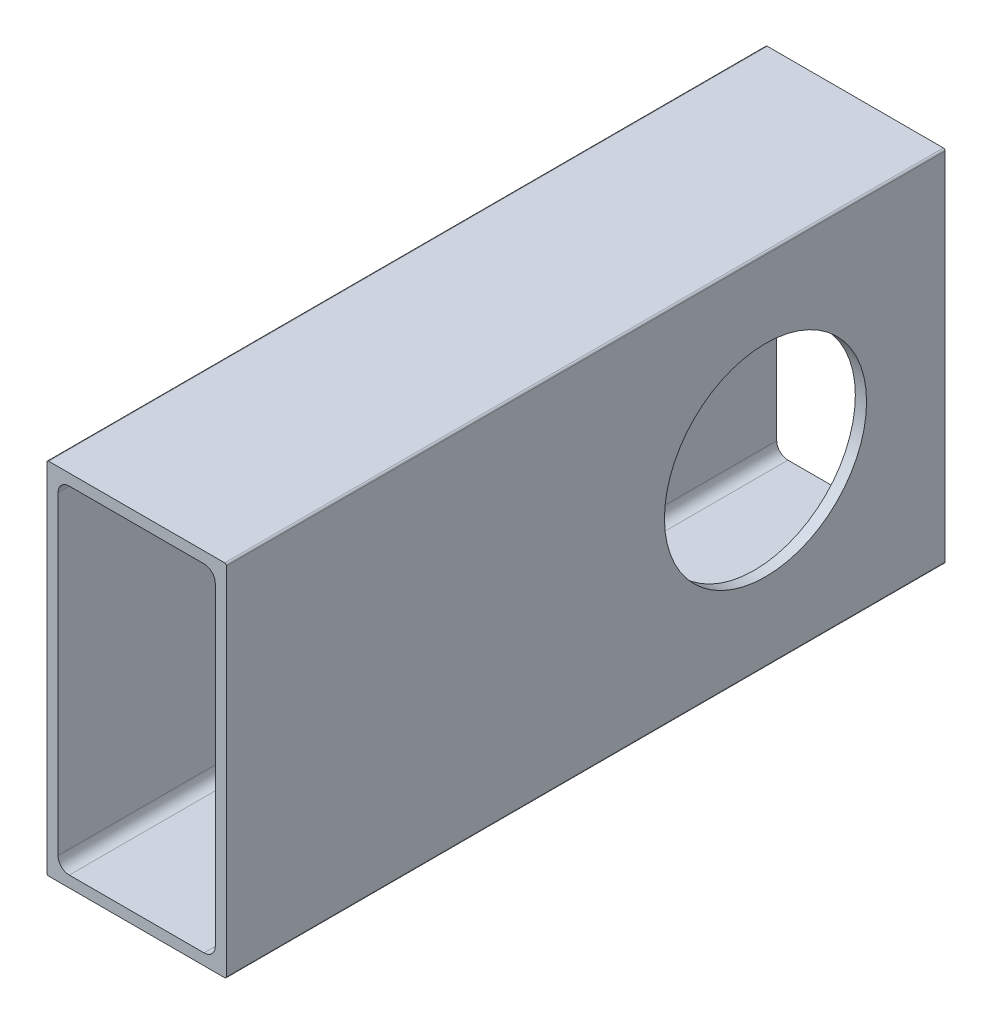
ISO-10303-21;
HEADER;
FILE_DESCRIPTION(('STEP AP214'),'2;1');
FILE_NAME('part.step','',(''),(''),'','','');
FILE_SCHEMA(('AUTOMOTIVE_DESIGN { 1 0 10303 214 1 1 1 1 }'));
ENDSEC;
DATA;
#1=APPLICATION_CONTEXT('core data for automotive mechanical design processes');
#2=APPLICATION_PROTOCOL_DEFINITION('international standard','automotive_design',2000,#1);
#3=PRODUCT_CONTEXT('',#1,'mechanical');
#4=PRODUCT('Part','Part','',(#3));
#5=PRODUCT_RELATED_PRODUCT_CATEGORY('part','',(#4));
#6=PRODUCT_DEFINITION_FORMATION('','',#4);
#7=PRODUCT_DEFINITION_CONTEXT('part definition',#1,'design');
#8=PRODUCT_DEFINITION('design','',#6,#7);
#9=PRODUCT_DEFINITION_SHAPE('','',#8);
#10=(LENGTH_UNIT() NAMED_UNIT(*) SI_UNIT(.MILLI.,.METRE.));
#11=(NAMED_UNIT(*) PLANE_ANGLE_UNIT() SI_UNIT($,.RADIAN.));
#12=(NAMED_UNIT(*) SI_UNIT($,.STERADIAN.) SOLID_ANGLE_UNIT());
#13=UNCERTAINTY_MEASURE_WITH_UNIT(LENGTH_MEASURE(1.E-05),#10,'distance_accuracy_value','');
#14=(GEOMETRIC_REPRESENTATION_CONTEXT(3) GLOBAL_UNCERTAINTY_ASSIGNED_CONTEXT((#13)) GLOBAL_UNIT_ASSIGNED_CONTEXT((#10,
#11,#12)) REPRESENTATION_CONTEXT('',''));
#15=CARTESIAN_POINT('',(0.,0.,0.));
#16=DIRECTION('',(0.,0.,1.));
#17=DIRECTION('',(1.,0.,0.));
#18=AXIS2_PLACEMENT_3D('',#15,#16,#17);
#19=CARTESIAN_POINT('',(12.446,25.146,101.6));
#20=DIRECTION('',(0.,0.,-1.));
#21=DIRECTION('',(-1.,0.,0.));
#22=AXIS2_PLACEMENT_3D('',#19,#20,#21);
#23=CYLINDRICAL_SURFACE('',#22,0.253999999999998);
#24=CARTESIAN_POINT('',(12.446,25.146,0.));
#25=DIRECTION('',(0.,0.,-1.));
#26=DIRECTION('',(-1.,0.,0.));
#27=AXIS2_PLACEMENT_3D('',#24,#25,#26);
#28=CIRCLE('',#27,0.253999999999998);
#29=CARTESIAN_POINT('',(12.446,25.4,0.));
#30=VERTEX_POINT('',#29);
#31=CARTESIAN_POINT('',(12.7,25.146,0.));
#32=VERTEX_POINT('',#31);
#33=EDGE_CURVE('E208',#30,#32,#28,.T.);
#34=ORIENTED_EDGE('',*,*,#33,.F.);
#35=DIRECTION('',(0.,0.,-1.));
#36=VECTOR('',#35,1.);
#37=CARTESIAN_POINT('',(12.446,25.4,101.6));
#38=LINE('',#37,#36);
#39=CARTESIAN_POINT('',(12.446,25.4,101.6));
#40=VERTEX_POINT('',#39);
#41=EDGE_CURVE('E11',#40,#30,#38,.T.);
#42=ORIENTED_EDGE('',*,*,#41,.F.);
#43=CARTESIAN_POINT('',(12.446,25.146,101.6));
#44=DIRECTION('',(0.,0.,-1.));
#45=DIRECTION('',(-1.,0.,0.));
#46=AXIS2_PLACEMENT_3D('',#43,#44,#45);
#47=CIRCLE('',#46,0.253999999999998);
#48=CARTESIAN_POINT('',(12.7,25.146,101.6));
#49=VERTEX_POINT('',#48);
#50=EDGE_CURVE('E220',#40,#49,#47,.T.);
#51=ORIENTED_EDGE('',*,*,#50,.T.);
#52=DIRECTION('',(0.,0.,-1.));
#53=VECTOR('',#52,1.);
#54=CARTESIAN_POINT('',(12.7,25.146,101.6));
#55=LINE('',#54,#53);
#56=EDGE_CURVE('E245',#49,#32,#55,.T.);
#57=ORIENTED_EDGE('',*,*,#56,.T.);
#58=EDGE_LOOP('',(#34,#42,#51,#57));
#59=FACE_BOUND('',#58,.T.);
#60=ADVANCED_FACE('F35',(#59),#23,.T.);
#61=CARTESIAN_POINT('',(-12.446,25.4,101.6));
#62=DIRECTION('',(0.,1.,0.));
#63=DIRECTION('',(0.,0.,1.));
#64=AXIS2_PLACEMENT_3D('',#61,#62,#63);
#65=PLANE('',#64);
#66=DIRECTION('',(1.,0.,0.));
#67=VECTOR('',#66,1.);
#68=CARTESIAN_POINT('',(-12.446,25.4,0.));
#69=LINE('',#68,#67);
#70=CARTESIAN_POINT('',(-12.446,25.4,0.));
#71=VERTEX_POINT('',#70);
#72=EDGE_CURVE('E224',#71,#30,#69,.T.);
#73=ORIENTED_EDGE('',*,*,#72,.F.);
#74=DIRECTION('',(0.,0.,-1.));
#75=VECTOR('',#74,1.);
#76=CARTESIAN_POINT('',(-12.446,25.4,101.6));
#77=LINE('',#76,#75);
#78=CARTESIAN_POINT('',(-12.446,25.4,101.6));
#79=VERTEX_POINT('',#78);
#80=EDGE_CURVE('E43',#79,#71,#77,.T.);
#81=ORIENTED_EDGE('',*,*,#80,.F.);
#82=DIRECTION('',(1.,0.,0.));
#83=VECTOR('',#82,1.);
#84=CARTESIAN_POINT('',(-12.446,25.4,101.6));
#85=LINE('',#84,#83);
#86=EDGE_CURVE('E242',#79,#40,#85,.T.);
#87=ORIENTED_EDGE('',*,*,#86,.T.);
#88=ORIENTED_EDGE('',*,*,#41,.T.);
#89=EDGE_LOOP('',(#73,#81,#87,#88));
#90=FACE_BOUND('',#89,.T.);
#91=ADVANCED_FACE('F291',(#90),#65,.T.);
#92=CARTESIAN_POINT('',(-12.446,25.146,101.6));
#93=DIRECTION('',(0.,0.,-1.));
#94=DIRECTION('',(-1.,0.,0.));
#95=AXIS2_PLACEMENT_3D('',#92,#93,#94);
#96=CYLINDRICAL_SURFACE('',#95,0.253999999999998);
#97=CARTESIAN_POINT('',(-12.446,25.146,0.));
#98=DIRECTION('',(0.,0.,-1.));
#99=DIRECTION('',(-1.,0.,0.));
#100=AXIS2_PLACEMENT_3D('',#97,#98,#99);
#101=CIRCLE('',#100,0.253999999999998);
#102=CARTESIAN_POINT('',(-12.7,25.146,0.));
#103=VERTEX_POINT('',#102);
#104=EDGE_CURVE('E263',#103,#71,#101,.T.);
#105=ORIENTED_EDGE('',*,*,#104,.F.);
#106=DIRECTION('',(0.,0.,-1.));
#107=VECTOR('',#106,1.);
#108=CARTESIAN_POINT('',(-12.7,25.146,101.6));
#109=LINE('',#108,#107);
#110=CARTESIAN_POINT('',(-12.7,25.146,101.6));
#111=VERTEX_POINT('',#110);
#112=EDGE_CURVE('E269',#111,#103,#109,.T.);
#113=ORIENTED_EDGE('',*,*,#112,.F.);
#114=CARTESIAN_POINT('',(-12.446,25.146,101.6));
#115=DIRECTION('',(0.,0.,-1.));
#116=DIRECTION('',(-1.,0.,0.));
#117=AXIS2_PLACEMENT_3D('',#114,#115,#116);
#118=CIRCLE('',#117,0.253999999999998);
#119=EDGE_CURVE('E239',#111,#79,#118,.T.);
#120=ORIENTED_EDGE('',*,*,#119,.T.);
#121=ORIENTED_EDGE('',*,*,#80,.T.);
#122=EDGE_LOOP('',(#105,#113,#120,#121));
#123=FACE_BOUND('',#122,.T.);
#124=ADVANCED_FACE('F310',(#123),#96,.T.);
#125=CARTESIAN_POINT('',(-12.7,-25.146,101.6));
#126=DIRECTION('',(-1.,0.,0.));
#127=DIRECTION('',(0.,0.,1.));
#128=AXIS2_PLACEMENT_3D('',#125,#126,#127);
#129=PLANE('',#128);
#130=CARTESIAN_POINT('',(-12.7,0.,25.4));
#131=DIRECTION('',(-1.,0.,0.));
#132=DIRECTION('',(0.,0.,1.));
#133=AXIS2_PLACEMENT_3D('',#130,#131,#132);
#134=CIRCLE('',#133,14.2875);
#135=CARTESIAN_POINT('',(-12.7,0.,39.6875));
#136=VERTEX_POINT('',#135);
#137=EDGE_CURVE('E491',#136,#136,#134,.T.);
#138=ORIENTED_EDGE('',*,*,#137,.F.);
#139=EDGE_LOOP('',(#138));
#140=FACE_BOUND('',#139,.T.);
#141=DIRECTION('',(0.,1.,0.));
#142=VECTOR('',#141,1.);
#143=CARTESIAN_POINT('',(-12.7,-25.146,0.));
#144=LINE('',#143,#142);
#145=CARTESIAN_POINT('',(-12.7,-25.146,0.));
#146=VERTEX_POINT('',#145);
#147=EDGE_CURVE('E260',#146,#103,#144,.T.);
#148=ORIENTED_EDGE('',*,*,#147,.F.);
#149=DIRECTION('',(0.,0.,-1.));
#150=VECTOR('',#149,1.);
#151=CARTESIAN_POINT('',(-12.7,-25.146,101.6));
#152=LINE('',#151,#150);
#153=CARTESIAN_POINT('',(-12.7,-25.146,101.6));
#154=VERTEX_POINT('',#153);
#155=EDGE_CURVE('E271',#154,#146,#152,.T.);
#156=ORIENTED_EDGE('',*,*,#155,.F.);
#157=DIRECTION('',(0.,1.,0.));
#158=VECTOR('',#157,1.);
#159=CARTESIAN_POINT('',(-12.7,-25.146,101.6));
#160=LINE('',#159,#158);
#161=EDGE_CURVE('E236',#154,#111,#160,.T.);
#162=ORIENTED_EDGE('',*,*,#161,.T.);
#163=ORIENTED_EDGE('',*,*,#112,.T.);
#164=EDGE_LOOP('',(#148,#156,#162,#163));
#165=FACE_BOUND('',#164,.T.);
#166=ADVANCED_FACE('F308',(#140,#165),#129,.T.);
#167=CARTESIAN_POINT('',(-12.446,-25.146,101.6));
#168=DIRECTION('',(0.,0.,-1.));
#169=DIRECTION('',(-1.,0.,0.));
#170=AXIS2_PLACEMENT_3D('',#167,#168,#169);
#171=CYLINDRICAL_SURFACE('',#170,0.253999999999998);
#172=CARTESIAN_POINT('',(-12.446,-25.146,0.));
#173=DIRECTION('',(0.,0.,-1.));
#174=DIRECTION('',(-1.,0.,0.));
#175=AXIS2_PLACEMENT_3D('',#172,#173,#174);
#176=CIRCLE('',#175,0.253999999999998);
#177=CARTESIAN_POINT('',(-12.446,-25.4,0.));
#178=VERTEX_POINT('',#177);
#179=EDGE_CURVE('E257',#178,#146,#176,.T.);
#180=ORIENTED_EDGE('',*,*,#179,.F.);
#181=DIRECTION('',(0.,0.,-1.));
#182=VECTOR('',#181,1.);
#183=CARTESIAN_POINT('',(-12.446,-25.4,101.6));
#184=LINE('',#183,#182);
#185=CARTESIAN_POINT('',(-12.446,-25.4,101.6));
#186=VERTEX_POINT('',#185);
#187=EDGE_CURVE('E273',#186,#178,#184,.T.);
#188=ORIENTED_EDGE('',*,*,#187,.F.);
#189=CARTESIAN_POINT('',(-12.446,-25.146,101.6));
#190=DIRECTION('',(0.,0.,-1.));
#191=DIRECTION('',(-1.,0.,0.));
#192=AXIS2_PLACEMENT_3D('',#189,#190,#191);
#193=CIRCLE('',#192,0.253999999999998);
#194=EDGE_CURVE('E233',#186,#154,#193,.T.);
#195=ORIENTED_EDGE('',*,*,#194,.T.);
#196=ORIENTED_EDGE('',*,*,#155,.T.);
#197=EDGE_LOOP('',(#180,#188,#195,#196));
#198=FACE_BOUND('',#197,.T.);
#199=ADVANCED_FACE('F304',(#198),#171,.T.);
#200=CARTESIAN_POINT('',(12.446,-25.4,101.6));
#201=DIRECTION('',(0.,-1.,0.));
#202=DIRECTION('',(0.,0.,-1.));
#203=AXIS2_PLACEMENT_3D('',#200,#201,#202);
#204=PLANE('',#203);
#205=DIRECTION('',(-1.,0.,0.));
#206=VECTOR('',#205,1.);
#207=CARTESIAN_POINT('',(12.446,-25.4,0.));
#208=LINE('',#207,#206);
#209=CARTESIAN_POINT('',(12.446,-25.4,0.));
#210=VERTEX_POINT('',#209);
#211=EDGE_CURVE('E254',#210,#178,#208,.T.);
#212=ORIENTED_EDGE('',*,*,#211,.F.);
#213=DIRECTION('',(0.,0.,-1.));
#214=VECTOR('',#213,1.);
#215=CARTESIAN_POINT('',(12.446,-25.4,101.6));
#216=LINE('',#215,#214);
#217=CARTESIAN_POINT('',(12.446,-25.4,101.6));
#218=VERTEX_POINT('',#217);
#219=EDGE_CURVE('E275',#218,#210,#216,.T.);
#220=ORIENTED_EDGE('',*,*,#219,.F.);
#221=DIRECTION('',(-1.,0.,0.));
#222=VECTOR('',#221,1.);
#223=CARTESIAN_POINT('',(12.446,-25.4,101.6));
#224=LINE('',#223,#222);
#225=EDGE_CURVE('E230',#218,#186,#224,.T.);
#226=ORIENTED_EDGE('',*,*,#225,.T.);
#227=ORIENTED_EDGE('',*,*,#187,.T.);
#228=EDGE_LOOP('',(#212,#220,#226,#227));
#229=FACE_BOUND('',#228,.T.);
#230=ADVANCED_FACE('F302',(#229),#204,.T.);
#231=CARTESIAN_POINT('',(12.446,-25.146,101.6));
#232=DIRECTION('',(0.,0.,-1.));
#233=DIRECTION('',(-1.,0.,0.));
#234=AXIS2_PLACEMENT_3D('',#231,#232,#233);
#235=CYLINDRICAL_SURFACE('',#234,0.253999999999998);
#236=CARTESIAN_POINT('',(12.446,-25.146,0.));
#237=DIRECTION('',(0.,0.,-1.));
#238=DIRECTION('',(-1.,0.,0.));
#239=AXIS2_PLACEMENT_3D('',#236,#237,#238);
#240=CIRCLE('',#239,0.253999999999998);
#241=CARTESIAN_POINT('',(12.7,-25.146,0.));
#242=VERTEX_POINT('',#241);
#243=EDGE_CURVE('E251',#242,#210,#240,.T.);
#244=ORIENTED_EDGE('',*,*,#243,.F.);
#245=DIRECTION('',(0.,0.,-1.));
#246=VECTOR('',#245,1.);
#247=CARTESIAN_POINT('',(12.7,-25.146,101.6));
#248=LINE('',#247,#246);
#249=CARTESIAN_POINT('',(12.7,-25.146,101.6));
#250=VERTEX_POINT('',#249);
#251=EDGE_CURVE('E277',#250,#242,#248,.T.);
#252=ORIENTED_EDGE('',*,*,#251,.F.);
#253=CARTESIAN_POINT('',(12.446,-25.146,101.6));
#254=DIRECTION('',(0.,0.,-1.));
#255=DIRECTION('',(-1.,0.,0.));
#256=AXIS2_PLACEMENT_3D('',#253,#254,#255);
#257=CIRCLE('',#256,0.253999999999998);
#258=EDGE_CURVE('E227',#250,#218,#257,.T.);
#259=ORIENTED_EDGE('',*,*,#258,.T.);
#260=ORIENTED_EDGE('',*,*,#219,.T.);
#261=EDGE_LOOP('',(#244,#252,#259,#260));
#262=FACE_BOUND('',#261,.T.);
#263=ADVANCED_FACE('F298',(#262),#235,.T.);
#264=CARTESIAN_POINT('',(12.7,25.146,101.6));
#265=DIRECTION('',(1.,0.,0.));
#266=DIRECTION('',(0.,0.,-1.));
#267=AXIS2_PLACEMENT_3D('',#264,#265,#266);
#268=PLANE('',#267);
#269=CARTESIAN_POINT('',(12.7,0.,25.4));
#270=DIRECTION('',(1.,0.,0.));
#271=DIRECTION('',(0.,0.,-1.));
#272=AXIS2_PLACEMENT_3D('',#269,#270,#271);
#273=CIRCLE('',#272,14.2875);
#274=CARTESIAN_POINT('',(12.7,0.,11.1125));
#275=VERTEX_POINT('',#274);
#276=EDGE_CURVE('E173',#275,#275,#273,.T.);
#277=ORIENTED_EDGE('',*,*,#276,.F.);
#278=EDGE_LOOP('',(#277));
#279=FACE_BOUND('',#278,.T.);
#280=DIRECTION('',(0.,-1.,0.));
#281=VECTOR('',#280,1.);
#282=CARTESIAN_POINT('',(12.7,25.146,0.));
#283=LINE('',#282,#281);
#284=EDGE_CURVE('E248',#32,#242,#283,.T.);
#285=ORIENTED_EDGE('',*,*,#284,.F.);
#286=ORIENTED_EDGE('',*,*,#56,.F.);
#287=DIRECTION('',(0.,-1.,0.));
#288=VECTOR('',#287,1.);
#289=CARTESIAN_POINT('',(12.7,25.146,101.6));
#290=LINE('',#289,#288);
#291=EDGE_CURVE('E223',#49,#250,#290,.T.);
#292=ORIENTED_EDGE('',*,*,#291,.T.);
#293=ORIENTED_EDGE('',*,*,#251,.T.);
#294=EDGE_LOOP('',(#285,#286,#292,#293));
#295=FACE_BOUND('',#294,.T.);
#296=ADVANCED_FACE('F284',(#279,#295),#268,.T.);
#297=CARTESIAN_POINT('',(12.446,25.146,101.6));
#298=DIRECTION('',(0.,0.,-1.));
#299=DIRECTION('',(-1.,0.,0.));
#300=AXIS2_PLACEMENT_3D('',#297,#298,#299);
#301=PLANE('',#300);
#302=DIRECTION('',(0.,-1.,0.));
#303=VECTOR('',#302,1.);
#304=CARTESIAN_POINT('',(11.1125,-22.225,101.6));
#305=LINE('',#304,#303);
#306=CARTESIAN_POINT('',(11.1125,22.225,101.6));
#307=VERTEX_POINT('',#306);
#308=CARTESIAN_POINT('',(11.1125,-22.225,101.6));
#309=VERTEX_POINT('',#308);
#310=EDGE_CURVE('E156',#307,#309,#305,.T.);
#311=ORIENTED_EDGE('',*,*,#310,.T.);
#312=CARTESIAN_POINT('',(9.525,-22.225,101.6));
#313=DIRECTION('',(0.,0.,-1.));
#314=DIRECTION('',(1.,0.,0.));
#315=AXIS2_PLACEMENT_3D('',#312,#313,#314);
#316=CIRCLE('',#315,1.5875);
#317=CARTESIAN_POINT('',(9.525,-23.8125,101.6));
#318=VERTEX_POINT('',#317);
#319=EDGE_CURVE('E150',#309,#318,#316,.T.);
#320=ORIENTED_EDGE('',*,*,#319,.T.);
#321=DIRECTION('',(-1.,0.,0.));
#322=VECTOR('',#321,1.);
#323=CARTESIAN_POINT('',(-9.525,-23.8125,101.6));
#324=LINE('',#323,#322);
#325=CARTESIAN_POINT('',(-9.525,-23.8125,101.6));
#326=VERTEX_POINT('',#325);
#327=EDGE_CURVE('E159',#318,#326,#324,.T.);
#328=ORIENTED_EDGE('',*,*,#327,.T.);
#329=CARTESIAN_POINT('',(-9.525,-22.225,101.6));
#330=DIRECTION('',(0.,0.,-1.));
#331=DIRECTION('',(1.,0.,0.));
#332=AXIS2_PLACEMENT_3D('',#329,#330,#331);
#333=CIRCLE('',#332,1.5875);
#334=CARTESIAN_POINT('',(-11.1125,-22.225,101.6));
#335=VERTEX_POINT('',#334);
#336=EDGE_CURVE('E51',#326,#335,#333,.T.);
#337=ORIENTED_EDGE('',*,*,#336,.T.);
#338=DIRECTION('',(0.,1.,0.));
#339=VECTOR('',#338,1.);
#340=CARTESIAN_POINT('',(-11.1125,22.225,101.6));
#341=LINE('',#340,#339);
#342=CARTESIAN_POINT('',(-11.1125,22.225,101.6));
#343=VERTEX_POINT('',#342);
#344=EDGE_CURVE('E177',#335,#343,#341,.T.);
#345=ORIENTED_EDGE('',*,*,#344,.T.);
#346=CARTESIAN_POINT('',(-9.525,22.225,101.6));
#347=DIRECTION('',(0.,0.,-1.));
#348=DIRECTION('',(1.,0.,0.));
#349=AXIS2_PLACEMENT_3D('',#346,#347,#348);
#350=CIRCLE('',#349,1.5875);
#351=CARTESIAN_POINT('',(-9.525,23.8125,101.6));
#352=VERTEX_POINT('',#351);
#353=EDGE_CURVE('E180',#343,#352,#350,.T.);
#354=ORIENTED_EDGE('',*,*,#353,.T.);
#355=DIRECTION('',(1.,0.,0.));
#356=VECTOR('',#355,1.);
#357=CARTESIAN_POINT('',(9.525,23.8125,101.6));
#358=LINE('',#357,#356);
#359=CARTESIAN_POINT('',(9.525,23.8125,101.6));
#360=VERTEX_POINT('',#359);
#361=EDGE_CURVE('E183',#352,#360,#358,.T.);
#362=ORIENTED_EDGE('',*,*,#361,.T.);
#363=CARTESIAN_POINT('',(9.525,22.225,101.6));
#364=DIRECTION('',(0.,0.,-1.));
#365=DIRECTION('',(1.,0.,0.));
#366=AXIS2_PLACEMENT_3D('',#363,#364,#365);
#367=CIRCLE('',#366,1.5875);
#368=EDGE_CURVE('E186',#360,#307,#367,.T.);
#369=ORIENTED_EDGE('',*,*,#368,.T.);
#370=EDGE_LOOP('',(#311,#320,#328,#337,#345,#354,#362,#369));
#371=FACE_BOUND('',#370,.T.);
#372=ORIENTED_EDGE('',*,*,#50,.F.);
#373=ORIENTED_EDGE('',*,*,#86,.F.);
#374=ORIENTED_EDGE('',*,*,#119,.F.);
#375=ORIENTED_EDGE('',*,*,#161,.F.);
#376=ORIENTED_EDGE('',*,*,#194,.F.);
#377=ORIENTED_EDGE('',*,*,#225,.F.);
#378=ORIENTED_EDGE('',*,*,#258,.F.);
#379=ORIENTED_EDGE('',*,*,#291,.F.);
#380=EDGE_LOOP('',(#372,#373,#374,#375,#376,#377,#378,#379));
#381=FACE_BOUND('',#380,.T.);
#382=ADVANCED_FACE('F163',(#371,#381),#301,.F.);
#383=CARTESIAN_POINT('',(12.446,25.146,0.));
#384=DIRECTION('',(0.,0.,-1.));
#385=DIRECTION('',(-1.,0.,0.));
#386=AXIS2_PLACEMENT_3D('',#383,#384,#385);
#387=PLANE('',#386);
#388=CARTESIAN_POINT('',(9.525,-22.225,0.));
#389=DIRECTION('',(0.,0.,-1.));
#390=DIRECTION('',(1.,0.,0.));
#391=AXIS2_PLACEMENT_3D('',#388,#389,#390);
#392=CIRCLE('',#391,1.5875);
#393=CARTESIAN_POINT('',(11.1125,-22.225,0.));
#394=VERTEX_POINT('',#393);
#395=CARTESIAN_POINT('',(9.525,-23.8125,0.));
#396=VERTEX_POINT('',#395);
#397=EDGE_CURVE('E59',#394,#396,#392,.T.);
#398=ORIENTED_EDGE('',*,*,#397,.F.);
#399=DIRECTION('',(0.,-1.,0.));
#400=VECTOR('',#399,1.);
#401=CARTESIAN_POINT('',(11.1125,-22.225,0.));
#402=LINE('',#401,#400);
#403=CARTESIAN_POINT('',(11.1125,22.225,0.));
#404=VERTEX_POINT('',#403);
#405=EDGE_CURVE('E167',#404,#394,#402,.T.);
#406=ORIENTED_EDGE('',*,*,#405,.F.);
#407=CARTESIAN_POINT('',(9.525,22.225,0.));
#408=DIRECTION('',(0.,0.,-1.));
#409=DIRECTION('',(1.,0.,0.));
#410=AXIS2_PLACEMENT_3D('',#407,#408,#409);
#411=CIRCLE('',#410,1.5875);
#412=CARTESIAN_POINT('',(9.525,23.8125,0.));
#413=VERTEX_POINT('',#412);
#414=EDGE_CURVE('E170',#413,#404,#411,.T.);
#415=ORIENTED_EDGE('',*,*,#414,.F.);
#416=DIRECTION('',(1.,0.,0.));
#417=VECTOR('',#416,1.);
#418=CARTESIAN_POINT('',(9.525,23.8125,0.));
#419=LINE('',#418,#417);
#420=CARTESIAN_POINT('',(-9.525,23.8125,0.));
#421=VERTEX_POINT('',#420);
#422=EDGE_CURVE('E201',#421,#413,#419,.T.);
#423=ORIENTED_EDGE('',*,*,#422,.F.);
#424=CARTESIAN_POINT('',(-9.525,22.225,0.));
#425=DIRECTION('',(0.,0.,-1.));
#426=DIRECTION('',(1.,0.,0.));
#427=AXIS2_PLACEMENT_3D('',#424,#425,#426);
#428=CIRCLE('',#427,1.5875);
#429=CARTESIAN_POINT('',(-11.1125,22.225,0.));
#430=VERTEX_POINT('',#429);
#431=EDGE_CURVE('E198',#430,#421,#428,.T.);
#432=ORIENTED_EDGE('',*,*,#431,.F.);
#433=DIRECTION('',(0.,1.,0.));
#434=VECTOR('',#433,1.);
#435=CARTESIAN_POINT('',(-11.1125,22.225,0.));
#436=LINE('',#435,#434);
#437=CARTESIAN_POINT('',(-11.1125,-22.225,0.));
#438=VERTEX_POINT('',#437);
#439=EDGE_CURVE('E195',#438,#430,#436,.T.);
#440=ORIENTED_EDGE('',*,*,#439,.F.);
#441=CARTESIAN_POINT('',(-9.525,-22.225,0.));
#442=DIRECTION('',(0.,0.,-1.));
#443=DIRECTION('',(1.,0.,0.));
#444=AXIS2_PLACEMENT_3D('',#441,#442,#443);
#445=CIRCLE('',#444,1.5875);
#446=CARTESIAN_POINT('',(-9.525,-23.8125,0.));
#447=VERTEX_POINT('',#446);
#448=EDGE_CURVE('E192',#447,#438,#445,.T.);
#449=ORIENTED_EDGE('',*,*,#448,.F.);
#450=DIRECTION('',(-1.,0.,0.));
#451=VECTOR('',#450,1.);
#452=CARTESIAN_POINT('',(-9.525,-23.8125,0.));
#453=LINE('',#452,#451);
#454=EDGE_CURVE('E190',#396,#447,#453,.T.);
#455=ORIENTED_EDGE('',*,*,#454,.F.);
#456=EDGE_LOOP('',(#398,#406,#415,#423,#432,#440,#449,#455));
#457=FACE_BOUND('',#456,.T.);
#458=ORIENTED_EDGE('',*,*,#33,.T.);
#459=ORIENTED_EDGE('',*,*,#284,.T.);
#460=ORIENTED_EDGE('',*,*,#243,.T.);
#461=ORIENTED_EDGE('',*,*,#211,.T.);
#462=ORIENTED_EDGE('',*,*,#179,.T.);
#463=ORIENTED_EDGE('',*,*,#147,.T.);
#464=ORIENTED_EDGE('',*,*,#104,.T.);
#465=ORIENTED_EDGE('',*,*,#72,.T.);
#466=EDGE_LOOP('',(#458,#459,#460,#461,#462,#463,#464,#465));
#467=FACE_BOUND('',#466,.T.);
#468=ADVANCED_FACE('F287',(#457,#467),#387,.T.);
#469=CARTESIAN_POINT('',(9.525,-22.225,101.6));
#470=DIRECTION('',(0.,0.,-1.));
#471=DIRECTION('',(-1.,0.,0.));
#472=AXIS2_PLACEMENT_3D('',#469,#470,#471);
#473=CYLINDRICAL_SURFACE('',#472,1.5875);
#474=ORIENTED_EDGE('',*,*,#397,.T.);
#475=DIRECTION('',(0.,0.,-1.));
#476=VECTOR('',#475,1.);
#477=CARTESIAN_POINT('',(9.525,-23.8125,101.6));
#478=LINE('',#477,#476);
#479=EDGE_CURVE('E146',#318,#396,#478,.T.);
#480=ORIENTED_EDGE('',*,*,#479,.F.);
#481=ORIENTED_EDGE('',*,*,#319,.F.);
#482=DIRECTION('',(0.,0.,-1.));
#483=VECTOR('',#482,1.);
#484=CARTESIAN_POINT('',(11.1125,-22.225,101.6));
#485=LINE('',#484,#483);
#486=EDGE_CURVE('E206',#309,#394,#485,.T.);
#487=ORIENTED_EDGE('',*,*,#486,.T.);
#488=EDGE_LOOP('',(#474,#480,#481,#487));
#489=FACE_BOUND('',#488,.T.);
#490=ADVANCED_FACE('F148',(#489),#473,.F.);
#491=CARTESIAN_POINT('',(11.1125,-22.225,101.6));
#492=DIRECTION('',(1.,0.,0.));
#493=DIRECTION('',(0.,0.,-1.));
#494=AXIS2_PLACEMENT_3D('',#491,#492,#493);
#495=PLANE('',#494);
#496=CARTESIAN_POINT('',(11.1125,0.,25.4));
#497=DIRECTION('',(1.,0.,0.));
#498=DIRECTION('',(0.,0.,-1.));
#499=AXIS2_PLACEMENT_3D('',#496,#497,#498);
#500=CIRCLE('',#499,14.2875);
#501=CARTESIAN_POINT('',(11.1125,0.,11.1125));
#502=VERTEX_POINT('',#501);
#503=EDGE_CURVE('E489',#502,#502,#500,.T.);
#504=ORIENTED_EDGE('',*,*,#503,.T.);
#505=EDGE_LOOP('',(#504));
#506=FACE_BOUND('',#505,.T.);
#507=ORIENTED_EDGE('',*,*,#405,.T.);
#508=ORIENTED_EDGE('',*,*,#486,.F.);
#509=ORIENTED_EDGE('',*,*,#310,.F.);
#510=DIRECTION('',(0.,0.,-1.));
#511=VECTOR('',#510,1.);
#512=CARTESIAN_POINT('',(11.1125,22.225,101.6));
#513=LINE('',#512,#511);
#514=EDGE_CURVE('E209',#307,#404,#513,.T.);
#515=ORIENTED_EDGE('',*,*,#514,.T.);
#516=EDGE_LOOP('',(#507,#508,#509,#515));
#517=FACE_BOUND('',#516,.T.);
#518=ADVANCED_FACE('F384',(#506,#517),#495,.F.);
#519=CARTESIAN_POINT('',(9.525,22.225,101.6));
#520=DIRECTION('',(0.,0.,-1.));
#521=DIRECTION('',(-1.,0.,0.));
#522=AXIS2_PLACEMENT_3D('',#519,#520,#521);
#523=CYLINDRICAL_SURFACE('',#522,1.5875);
#524=ORIENTED_EDGE('',*,*,#414,.T.);
#525=ORIENTED_EDGE('',*,*,#514,.F.);
#526=ORIENTED_EDGE('',*,*,#368,.F.);
#527=DIRECTION('',(0.,0.,-1.));
#528=VECTOR('',#527,1.);
#529=CARTESIAN_POINT('',(9.525,23.8125,101.6));
#530=LINE('',#529,#528);
#531=EDGE_CURVE('E211',#360,#413,#530,.T.);
#532=ORIENTED_EDGE('',*,*,#531,.T.);
#533=EDGE_LOOP('',(#524,#525,#526,#532));
#534=FACE_BOUND('',#533,.T.);
#535=ADVANCED_FACE('F391',(#534),#523,.F.);
#536=CARTESIAN_POINT('',(9.525,23.8125,101.6));
#537=DIRECTION('',(0.,1.,0.));
#538=DIRECTION('',(0.,0.,1.));
#539=AXIS2_PLACEMENT_3D('',#536,#537,#538);
#540=PLANE('',#539);
#541=ORIENTED_EDGE('',*,*,#422,.T.);
#542=ORIENTED_EDGE('',*,*,#531,.F.);
#543=ORIENTED_EDGE('',*,*,#361,.F.);
#544=DIRECTION('',(0.,0.,-1.));
#545=VECTOR('',#544,1.);
#546=CARTESIAN_POINT('',(-9.525,23.8125,101.6));
#547=LINE('',#546,#545);
#548=EDGE_CURVE('E213',#352,#421,#547,.T.);
#549=ORIENTED_EDGE('',*,*,#548,.T.);
#550=EDGE_LOOP('',(#541,#542,#543,#549));
#551=FACE_BOUND('',#550,.T.);
#552=ADVANCED_FACE('F396',(#551),#540,.F.);
#553=CARTESIAN_POINT('',(-9.525,22.225,101.6));
#554=DIRECTION('',(0.,0.,-1.));
#555=DIRECTION('',(-1.,0.,0.));
#556=AXIS2_PLACEMENT_3D('',#553,#554,#555);
#557=CYLINDRICAL_SURFACE('',#556,1.5875);
#558=ORIENTED_EDGE('',*,*,#431,.T.);
#559=ORIENTED_EDGE('',*,*,#548,.F.);
#560=ORIENTED_EDGE('',*,*,#353,.F.);
#561=DIRECTION('',(0.,0.,-1.));
#562=VECTOR('',#561,1.);
#563=CARTESIAN_POINT('',(-11.1125,22.225,101.6));
#564=LINE('',#563,#562);
#565=EDGE_CURVE('E215',#343,#430,#564,.T.);
#566=ORIENTED_EDGE('',*,*,#565,.T.);
#567=EDGE_LOOP('',(#558,#559,#560,#566));
#568=FACE_BOUND('',#567,.T.);
#569=ADVANCED_FACE('F406',(#568),#557,.F.);
#570=CARTESIAN_POINT('',(-11.1125,22.225,101.6));
#571=DIRECTION('',(-1.,0.,0.));
#572=DIRECTION('',(0.,0.,1.));
#573=AXIS2_PLACEMENT_3D('',#570,#571,#572);
#574=PLANE('',#573);
#575=CARTESIAN_POINT('',(-11.1125,0.,25.4));
#576=DIRECTION('',(-1.,0.,0.));
#577=DIRECTION('',(0.,0.,1.));
#578=AXIS2_PLACEMENT_3D('',#575,#576,#577);
#579=CIRCLE('',#578,14.2875);
#580=CARTESIAN_POINT('',(-11.1125,0.,39.6875));
#581=VERTEX_POINT('',#580);
#582=EDGE_CURVE('E38',#581,#581,#579,.T.);
#583=ORIENTED_EDGE('',*,*,#582,.T.);
#584=EDGE_LOOP('',(#583));
#585=FACE_BOUND('',#584,.T.);
#586=ORIENTED_EDGE('',*,*,#439,.T.);
#587=ORIENTED_EDGE('',*,*,#565,.F.);
#588=ORIENTED_EDGE('',*,*,#344,.F.);
#589=DIRECTION('',(0.,0.,-1.));
#590=VECTOR('',#589,1.);
#591=CARTESIAN_POINT('',(-11.1125,-22.225,101.6));
#592=LINE('',#591,#590);
#593=EDGE_CURVE('E217',#335,#438,#592,.T.);
#594=ORIENTED_EDGE('',*,*,#593,.T.);
#595=EDGE_LOOP('',(#586,#587,#588,#594));
#596=FACE_BOUND('',#595,.T.);
#597=ADVANCED_FACE('F416',(#585,#596),#574,.F.);
#598=CARTESIAN_POINT('',(-9.525,-22.225,101.6));
#599=DIRECTION('',(0.,0.,-1.));
#600=DIRECTION('',(-1.,0.,0.));
#601=AXIS2_PLACEMENT_3D('',#598,#599,#600);
#602=CYLINDRICAL_SURFACE('',#601,1.5875);
#603=ORIENTED_EDGE('',*,*,#448,.T.);
#604=ORIENTED_EDGE('',*,*,#593,.F.);
#605=ORIENTED_EDGE('',*,*,#336,.F.);
#606=DIRECTION('',(0.,0.,-1.));
#607=VECTOR('',#606,1.);
#608=CARTESIAN_POINT('',(-9.525,-23.8125,101.6));
#609=LINE('',#608,#607);
#610=EDGE_CURVE('E155',#326,#447,#609,.T.);
#611=ORIENTED_EDGE('',*,*,#610,.T.);
#612=EDGE_LOOP('',(#603,#604,#605,#611));
#613=FACE_BOUND('',#612,.T.);
#614=ADVANCED_FACE('F424',(#613),#602,.F.);
#615=CARTESIAN_POINT('',(-9.525,-23.8125,101.6));
#616=DIRECTION('',(0.,-1.,0.));
#617=DIRECTION('',(0.,0.,-1.));
#618=AXIS2_PLACEMENT_3D('',#615,#616,#617);
#619=PLANE('',#618);
#620=ORIENTED_EDGE('',*,*,#454,.T.);
#621=ORIENTED_EDGE('',*,*,#610,.F.);
#622=ORIENTED_EDGE('',*,*,#327,.F.);
#623=ORIENTED_EDGE('',*,*,#479,.T.);
#624=EDGE_LOOP('',(#620,#621,#622,#623));
#625=FACE_BOUND('',#624,.T.);
#626=ADVANCED_FACE('F160',(#625),#619,.F.);
#627=CARTESIAN_POINT('',(38.1,0.,25.4));
#628=DIRECTION('',(-1.,0.,0.));
#629=DIRECTION('',(0.,0.,1.));
#630=AXIS2_PLACEMENT_3D('',#627,#628,#629);
#631=CYLINDRICAL_SURFACE('',#630,14.2875);
#632=ORIENTED_EDGE('',*,*,#137,.T.);
#633=EDGE_LOOP('',(#632));
#634=FACE_BOUND('',#633,.T.);
#635=ORIENTED_EDGE('',*,*,#582,.F.);
#636=EDGE_LOOP('',(#635));
#637=FACE_BOUND('',#636,.T.);
#638=ADVANCED_FACE('F437',(#634,#637),#631,.F.);
#639=ORIENTED_EDGE('',*,*,#276,.T.);
#640=EDGE_LOOP('',(#639));
#641=FACE_BOUND('',#640,.T.);
#642=ORIENTED_EDGE('',*,*,#503,.F.);
#643=EDGE_LOOP('',(#642));
#644=FACE_BOUND('',#643,.T.);
#645=ADVANCED_FACE('F471',(#641,#644),#631,.F.);
#646=CLOSED_SHELL('',(#60,#91,#124,#166,#199,#230,#263,#296,#382,#468,#490,#518,#535,#552,#569,
#597,#614,#626,#638,#645));
#647=MANIFOLD_SOLID_BREP('B2',#646);
#648=ADVANCED_BREP_SHAPE_REPRESENTATION('',(#18,#647),#14);
#649=SHAPE_DEFINITION_REPRESENTATION(#9,#648);
ENDSEC;
END-ISO-10303-21;
